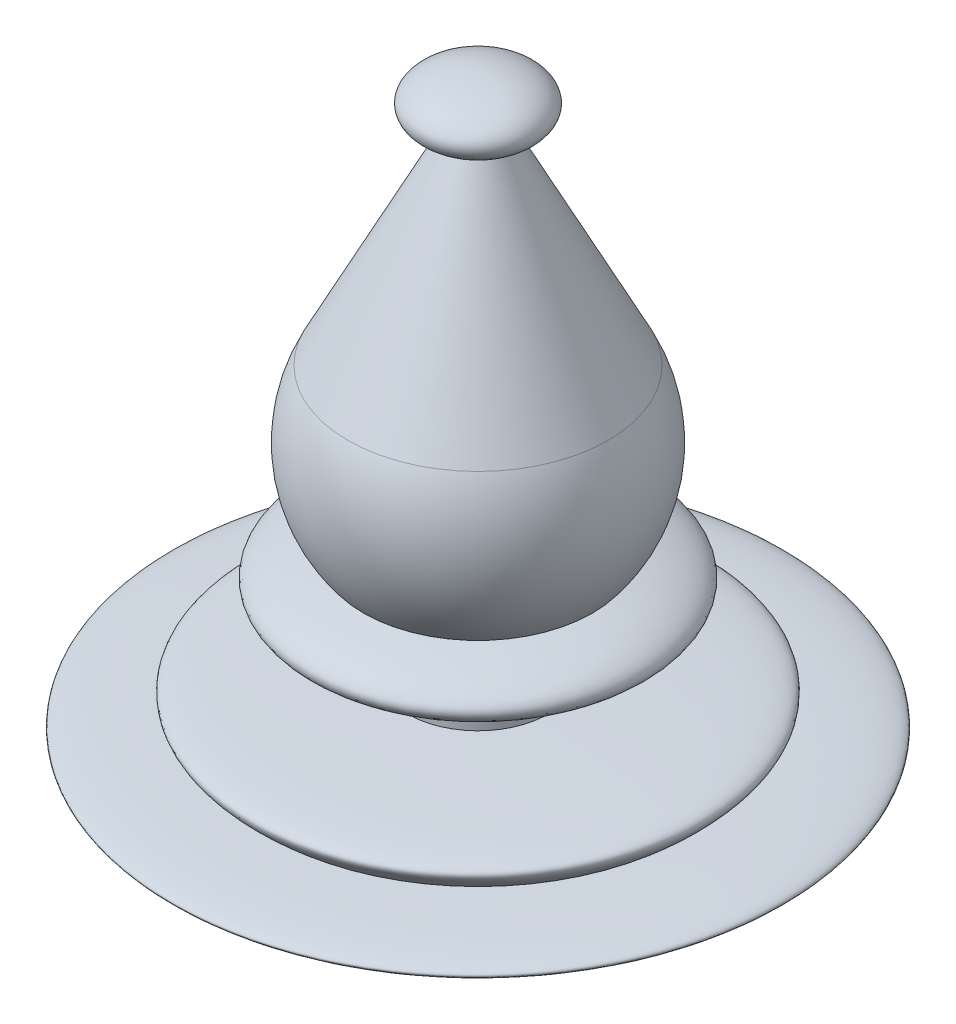
ISO-10303-21;
HEADER;
FILE_DESCRIPTION(('STEP AP214'),'2;1');
FILE_NAME('part.step','',(''),(''),'','','');
FILE_SCHEMA(('AUTOMOTIVE_DESIGN { 1 0 10303 214 1 1 1 1 }'));
ENDSEC;
DATA;
#1=APPLICATION_CONTEXT('core data for automotive mechanical design processes');
#2=APPLICATION_PROTOCOL_DEFINITION('international standard','automotive_design',2000,#1);
#3=PRODUCT_CONTEXT('',#1,'mechanical');
#4=PRODUCT('Part','Part','',(#3));
#5=PRODUCT_RELATED_PRODUCT_CATEGORY('part','',(#4));
#6=PRODUCT_DEFINITION_FORMATION('','',#4);
#7=PRODUCT_DEFINITION_CONTEXT('part definition',#1,'design');
#8=PRODUCT_DEFINITION('design','',#6,#7);
#9=PRODUCT_DEFINITION_SHAPE('','',#8);
#10=(LENGTH_UNIT() NAMED_UNIT(*) SI_UNIT(.MILLI.,.METRE.));
#11=(NAMED_UNIT(*) PLANE_ANGLE_UNIT() SI_UNIT($,.RADIAN.));
#12=(NAMED_UNIT(*) SI_UNIT($,.STERADIAN.) SOLID_ANGLE_UNIT());
#13=UNCERTAINTY_MEASURE_WITH_UNIT(LENGTH_MEASURE(1.E-05),#10,'distance_accuracy_value','');
#14=(GEOMETRIC_REPRESENTATION_CONTEXT(3) GLOBAL_UNCERTAINTY_ASSIGNED_CONTEXT((#13)) GLOBAL_UNIT_ASSIGNED_CONTEXT((#10,
#11,#12)) REPRESENTATION_CONTEXT('',''));
#15=CARTESIAN_POINT('',(0.,0.,0.));
#16=DIRECTION('',(0.,0.,1.));
#17=DIRECTION('',(1.,0.,0.));
#18=AXIS2_PLACEMENT_3D('',#15,#16,#17);
#19=CARTESIAN_POINT('',(6.00000000000001,-17.049402030691,0.));
#20=CARTESIAN_POINT('',(20.9160069814834,-17.5127391590238,0.));
#21=CARTESIAN_POINT('',(18.,-20.049402030691,0.));
#22=(BOUNDED_CURVE() B_SPLINE_CURVE(2,(#19,#20,#21),.UNSPECIFIED.,.F.,
.F.) B_SPLINE_CURVE_WITH_KNOTS((3,3),(0.,1.),
.UNSPECIFIED.) CURVE() GEOMETRIC_REPRESENTATION_ITEM() RATIONAL_B_SPLINE_CURVE((1.,
2.72010071933434,1.)) REPRESENTATION_ITEM(''));
#23=CARTESIAN_POINT('',(0.,27.2617133775583,0.));
#24=DIRECTION('',(0.,1.,0.));
#25=AXIS1_PLACEMENT('',#23,#24);
#26=SURFACE_OF_REVOLUTION('',#22,#25);
#27=CARTESIAN_POINT('',(0.,-20.049402030691,0.));
#28=DIRECTION('',(0.,1.,0.));
#29=DIRECTION('',(-1.,0.,0.));
#30=AXIS2_PLACEMENT_3D('',#27,#28,#29);
#31=CIRCLE('',#30,18.);
#32=CARTESIAN_POINT('',(-18.,-20.049402030691,0.));
#33=VERTEX_POINT('',#32);
#34=EDGE_CURVE('E74',#33,#33,#31,.T.);
#35=ORIENTED_EDGE('',*,*,#34,.T.);
#36=EDGE_LOOP('',(#35));
#37=FACE_BOUND('',#36,.T.);
#38=CARTESIAN_POINT('',(0.,-17.049402030691,0.));
#39=DIRECTION('',(0.,1.,0.));
#40=DIRECTION('',(-1.,0.,0.));
#41=AXIS2_PLACEMENT_3D('',#38,#39,#40);
#42=CIRCLE('',#41,6.);
#43=CARTESIAN_POINT('',(-6.,-17.049402030691,0.));
#44=VERTEX_POINT('',#43);
#45=EDGE_CURVE('E11',#44,#44,#42,.T.);
#46=ORIENTED_EDGE('',*,*,#45,.F.);
#47=EDGE_LOOP('',(#46));
#48=FACE_BOUND('',#47,.T.);
#49=ADVANCED_FACE('F47',(#37,#48),#26,.F.);
#50=CARTESIAN_POINT('',(0.,27.2617133775583,0.));
#51=DIRECTION('',(0.,1.,0.));
#52=DIRECTION('',(-1.,0.,0.));
#53=AXIS2_PLACEMENT_3D('',#50,#51,#52);
#54=CYLINDRICAL_SURFACE('',#53,6.);
#55=ORIENTED_EDGE('',*,*,#45,.T.);
#56=EDGE_LOOP('',(#55));
#57=FACE_BOUND('',#56,.T.);
#58=CARTESIAN_POINT('',(0.,-12.8021493208476,0.));
#59=DIRECTION('',(0.,1.,0.));
#60=DIRECTION('',(-1.,0.,0.));
#61=AXIS2_PLACEMENT_3D('',#58,#59,#60);
#62=CIRCLE('',#61,6.);
#63=CARTESIAN_POINT('',(-5.99999999999999,-12.8021493208476,0.));
#64=VERTEX_POINT('',#63);
#65=EDGE_CURVE('E56',#64,#64,#62,.T.);
#66=ORIENTED_EDGE('',*,*,#65,.F.);
#67=EDGE_LOOP('',(#66));
#68=FACE_BOUND('',#67,.T.);
#69=ADVANCED_FACE('F93',(#57,#68),#54,.T.);
#70=CARTESIAN_POINT('',(0.,-10.,0.));
#71=DIRECTION('',(0.,0.,1.));
#72=DIRECTION('',(1.,0.,0.));
#73=AXIS2_PLACEMENT_3D('',#70,#71,#72);
#74=ELLIPSE('',#73,14.3874945699382,3.08303455070103);
#75=TRIMMED_CURVE('',#74,(PARAMETER_VALUE(4.71238898038469)),
(PARAMETER_VALUE(7.85398163397448)),.T.,.PARAMETER.);
#76=CARTESIAN_POINT('',(0.,27.2617133775583,0.));
#77=DIRECTION('',(0.,1.,0.));
#78=AXIS1_PLACEMENT('',#76,#77);
#79=SURFACE_OF_REVOLUTION('',#75,#78);
#80=CARTESIAN_POINT('',(0.,-7.73374733032995,0.));
#81=DIRECTION('',(0.,1.,0.));
#82=DIRECTION('',(-1.,0.,0.));
#83=AXIS2_PLACEMENT_3D('',#80,#81,#82);
#84=CIRCLE('',#83,9.75456230633658);
#85=CARTESIAN_POINT('',(9.75456230633658,-7.73374733032995,0.));
#86=VERTEX_POINT('',#85);
#87=EDGE_CURVE('E79',#86,#86,#84,.T.);
#88=ORIENTED_EDGE('',*,*,#87,.F.);
#89=EDGE_LOOP('',(#88));
#90=FACE_BOUND('',#89,.T.);
#91=ORIENTED_EDGE('',*,*,#65,.T.);
#92=EDGE_LOOP('',(#91));
#93=FACE_BOUND('',#92,.T.);
#94=ADVANCED_FACE('F91',(#90,#93),#79,.T.);
#95=CARTESIAN_POINT('',(0.,0.,0.));
#96=DIRECTION('',(0.,1.,0.));
#97=DIRECTION('',(1.,0.,0.));
#98=AXIS2_PLACEMENT_3D('',#95,#96,#97);
#99=SPHERICAL_SURFACE('',#98,12.4483867853464);
#100=CARTESIAN_POINT('',(0.,5.67008957160824,0.));
#101=DIRECTION('',(0.,1.,0.));
#102=DIRECTION('',(-1.,0.,0.));
#103=AXIS2_PLACEMENT_3D('',#100,#101,#102);
#104=CIRCLE('',#103,11.0820764212997);
#105=CARTESIAN_POINT('',(11.0820764212997,5.67008957160824,0.));
#106=VERTEX_POINT('',#105);
#107=EDGE_CURVE('E73',#106,#106,#104,.T.);
#108=CARTESIAN_POINT('',(11.0820764212997,5.67008957160824,0.));
#109=CARTESIAN_POINT('',(11.1496033400676,5.5381122258004,0.));
#110=CARTESIAN_POINT('',(11.2147704914206,5.40492760103505,0.));
#111=CARTESIAN_POINT('',(11.3403069153199,5.1363160355714,0.));
#112=CARTESIAN_POINT('',(11.4006761878664,5.0008890948731,0.));
#113=CARTESIAN_POINT('',(11.5165385101762,4.72796513952557,0.));
#114=CARTESIAN_POINT('',(11.5720315599395,4.59046812487634,0.));
#115=CARTESIAN_POINT('',(11.6780709570877,4.31357967250652,0.));
#116=CARTESIAN_POINT('',(11.7286173044724,4.17418823478592,0.));
#117=CARTESIAN_POINT('',(11.8246986911405,3.89368879954967,0.));
#118=CARTESIAN_POINT('',(11.8702337304238,3.75258080203403,0.));
#119=CARTESIAN_POINT('',(11.9562344089541,3.46882835640334,0.));
#120=CARTESIAN_POINT('',(11.9967000482011,3.32618390828829,0.));
#121=CARTESIAN_POINT('',(12.0725102732844,3.03954061688942,0.));
#122=CARTESIAN_POINT('',(12.1078548591208,2.8955417736056,0.));
#123=CARTESIAN_POINT('',(12.1733778685189,2.60637347988094,0.));
#124=CARTESIAN_POINT('',(12.2035562920807,2.46120402944009,0.));
#125=CARTESIAN_POINT('',(12.2587084594241,2.16987980241168,0.));
#126=CARTESIAN_POINT('',(12.2836822032058,2.02372502582411,0.));
#127=CARTESIAN_POINT('',(12.3283931368764,1.73061668537805,0.));
#128=CARTESIAN_POINT('',(12.3481303267652,1.58366312151956,0.));
#129=CARTESIAN_POINT('',(12.3823429618411,1.28914476483165,0.));
#130=CARTESIAN_POINT('',(12.3968184070282,1.14157997200225,0.));
#131=CARTESIAN_POINT('',(12.420489077553,0.846027495810605,0.));
#132=CARTESIAN_POINT('',(12.4296843028907,0.69803981244837,0.));
#133=CARTESIAN_POINT('',(12.4427827977556,0.401830433363157,0.));
#134=CARTESIAN_POINT('',(12.4466860672827,0.253608737640178,0.));
#135=CARTESIAN_POINT('',(12.4491956687446,-0.0428794893206436,0.));
#136=CARTESIAN_POINT('',(12.4478020006794,-0.191146020558486,0.));
#137=CARTESIAN_POINT('',(12.4397195057093,-0.487534684479524,0.));
#138=CARTESIAN_POINT('',(12.4330306788043,-0.635656817162721,0.));
#139=CARTESIAN_POINT('',(12.4143664031718,-0.931567634202187,0.));
#140=CARTESIAN_POINT('',(12.4023909544443,-1.07935631855846,0.));
#141=CARTESIAN_POINT('',(12.3731687195528,-1.37441161475527,0.));
#142=CARTESIAN_POINT('',(12.3559219333888,-1.52167822659582,0.));
#143=CARTESIAN_POINT('',(12.3161790358715,-1.81550141989883,0.));
#144=CARTESIAN_POINT('',(12.2936829245181,-1.96205800136129,0.));
#145=CARTESIAN_POINT('',(12.243470088636,-2.25427408226464,0.));
#146=CARTESIAN_POINT('',(12.2157533641072,-2.39993358170553,0.));
#147=CARTESIAN_POINT('',(12.1551346770093,-2.69016959187726,0.));
#148=CARTESIAN_POINT('',(12.1222327144403,-2.83474610260809,0.));
#149=CARTESIAN_POINT('',(12.0512855443682,-3.12263161090008,0.));
#150=CARTESIAN_POINT('',(12.0132403368652,-3.26594060846123,0.));
#151=CARTESIAN_POINT('',(11.9320552344094,-3.55110818369611,0.));
#152=CARTESIAN_POINT('',(11.8889153394566,-3.69296676136985,0.));
#153=CARTESIAN_POINT('',(11.7975959219764,-3.97505244129007,0.));
#154=CARTESIAN_POINT('',(11.7494163994489,-4.11527954353654,0.));
#155=CARTESIAN_POINT('',(11.6480792188604,-4.39392329935949,0.));
#156=CARTESIAN_POINT('',(11.5949215607994,-4.53233995293595,0.));
#157=CARTESIAN_POINT('',(11.4836959546851,-4.8071861487635,0.));
#158=CARTESIAN_POINT('',(11.4256280066317,-4.9436156910146,0.));
#159=CARTESIAN_POINT('',(11.3046559336664,-5.21431353810372,0.));
#160=CARTESIAN_POINT('',(11.2417518087544,-5.34858184294175,0.));
#161=CARTESIAN_POINT('',(11.1111876656521,-5.61478584604299,0.));
#162=CARTESIAN_POINT('',(11.0435276474618,-5.7467215443062,0.));
#163=CARTESIAN_POINT('',(10.9035380788962,-6.00809194776057,0.));
#164=CARTESIAN_POINT('',(10.8312085285209,-6.13752665295172,0.));
#165=CARTESIAN_POINT('',(10.6819721883911,-6.39372985514981,0.));
#166=CARTESIAN_POINT('',(10.6050653986365,-6.52049835215675,0.));
#167=CARTESIAN_POINT('',(10.4467728192468,-6.77120740287784,0.));
#168=CARTESIAN_POINT('',(10.3653870296118,-6.89514795659199,0.));
#169=CARTESIAN_POINT('',(10.1982400157458,-7.14004270722834,0.));
#170=CARTESIAN_POINT('',(10.1124787915148,-7.26099690415053,0.));
#171=CARTESIAN_POINT('',(9.93669151666482,-7.49976541301858,0.));
#172=CARTESIAN_POINT('',(9.84666546604576,-7.61757972496444,0.));
#173=CARTESIAN_POINT('',(9.75456230633658,-7.73374733032995,0.));
#174=B_SPLINE_CURVE_WITH_KNOTS('',3,(#108,#109,#110,#111,#112,#113,#114,#115,#116,#117,#118,
#119,#120,#121,#122,#123,#124,#125,#126,#127,#128,#129,#130,#131,#132,#133,#134,#135,#136,#137,
#138,#139,#140,#141,#142,#143,#144,#145,#146,#147,#148,#149,#150,#151,#152,#153,#154,#155,#156,
#157,#158,#159,#160,#161,#162,#163,#164,#165,#166,#167,#168,#169,#170,#171,#172,#173),
.UNSPECIFIED.,.F.,.F.,(4,2,2,2,2,2,2,2,2,2,2,2,2,2,2,2,2,2,2,2,2,2,2,2,2,2,2,2,2,2,2,2,4),(0.,
0.44472462225828,0.889449244516561,1.33417386677484,1.77889848903312,2.2236231112914,
2.66834773354968,3.11307235580796,3.55779697806624,4.00252160032452,4.4472462225828,
4.89197084484108,5.33669546709936,5.78142008935764,6.22614471161592,6.6708693338742,
7.11559395613248,7.56031857839076,8.00504320064904,8.44976782290732,8.8944924451656,
9.33921706742388,9.78394168968216,10.2286663119404,10.6733909341987,11.118115556457,
11.5628401787153,12.0075648009736,12.4522894232318,12.8970140454901,13.3417386677484,
13.7864632900067,14.231187912265),.UNSPECIFIED.);
#175=EDGE_CURVE('BSEAM100',#106,#86,#174,.T.);
#176=ORIENTED_EDGE('',*,*,#107,.F.);
#177=ORIENTED_EDGE('',*,*,#87,.T.);
#178=ORIENTED_EDGE('',*,*,#175,.T.);
#179=ORIENTED_EDGE('',*,*,#175,.F.);
#180=EDGE_LOOP('',(#176,#178,#177,#179));
#181=FACE_BOUND('',#180,.T.);
#182=ADVANCED_FACE('F100',(#181),#99,.T.);
#183=CARTESIAN_POINT('',(0.,22.9729128370593,0.));
#184=DIRECTION('',(0.,-1.,0.));
#185=DIRECTION('',(1.,0.,0.));
#186=AXIS2_PLACEMENT_3D('',#183,#184,#185);
#187=CONICAL_SURFACE('',#186,2.22917250446247,0.472920192056634);
#188=CARTESIAN_POINT('',(0.,22.9729128370593,0.));
#189=DIRECTION('',(0.,1.,0.));
#190=DIRECTION('',(-1.,0.,0.));
#191=AXIS2_PLACEMENT_3D('',#188,#189,#190);
#192=CIRCLE('',#191,2.22917250446247);
#193=CARTESIAN_POINT('',(2.22917250446247,22.9729128370593,0.));
#194=VERTEX_POINT('',#193);
#195=EDGE_CURVE('E70',#194,#194,#192,.T.);
#196=CARTESIAN_POINT('',(11.0820764212997,5.67008957160824,0.));
#197=CARTESIAN_POINT('',(10.989858672166,5.85032731395669,0.));
#198=CARTESIAN_POINT('',(10.8976409230323,6.03056505630514,0.));
#199=CARTESIAN_POINT('',(10.7132054247648,6.39104054100204,0.));
#200=CARTESIAN_POINT('',(10.6209876756311,6.57127828335049,0.));
#201=CARTESIAN_POINT('',(10.4365521773637,6.93175376804738,0.));
#202=CARTESIAN_POINT('',(10.34433442823,7.11199151039583,0.));
#203=CARTESIAN_POINT('',(10.1598989299625,7.47246699509273,0.));
#204=CARTESIAN_POINT('',(10.0676811808288,7.65270473744117,0.));
#205=CARTESIAN_POINT('',(9.88324568256136,8.01318022213807,0.));
#206=CARTESIAN_POINT('',(9.79102793342764,8.19341796448652,0.));
#207=CARTESIAN_POINT('',(9.60659243516019,8.55389344918342,0.));
#208=CARTESIAN_POINT('',(9.51437468602647,8.73413119153187,0.));
#209=CARTESIAN_POINT('',(9.32993918775903,9.09460667622876,0.));
#210=CARTESIAN_POINT('',(9.23772143862531,9.27484441857721,0.));
#211=CARTESIAN_POINT('',(9.05328594035786,9.63531990327411,0.));
#212=CARTESIAN_POINT('',(8.96106819122414,9.81555764562256,0.));
#213=CARTESIAN_POINT('',(8.7766326929567,10.1760331303195,0.));
#214=CARTESIAN_POINT('',(8.68441494382298,10.3562708726679,0.));
#215=CARTESIAN_POINT('',(8.49997944555554,10.7167463573648,0.));
#216=CARTESIAN_POINT('',(8.40776169642181,10.8969840997132,0.));
#217=CARTESIAN_POINT('',(8.22332619815437,11.2574595844101,0.));
#218=CARTESIAN_POINT('',(8.13110844902065,11.4376973267586,0.));
#219=CARTESIAN_POINT('',(7.9466729507532,11.7981728114555,0.));
#220=CARTESIAN_POINT('',(7.85445520161948,11.9784105538039,0.));
#221=CARTESIAN_POINT('',(7.67001970335204,12.3388860385008,0.));
#222=CARTESIAN_POINT('',(7.57780195421832,12.5191237808493,0.));
#223=CARTESIAN_POINT('',(7.39336645595087,12.8795992655462,0.));
#224=CARTESIAN_POINT('',(7.30114870681715,13.0598370078946,0.));
#225=CARTESIAN_POINT('',(7.11671320854971,13.4203124925915,0.));
#226=CARTESIAN_POINT('',(7.02449545941599,13.60055023494,0.));
#227=CARTESIAN_POINT('',(6.84005996114854,13.9610257196369,0.));
#228=CARTESIAN_POINT('',(6.74784221201482,14.1412634619853,0.));
#229=CARTESIAN_POINT('',(6.56340671374738,14.5017389466822,0.));
#230=CARTESIAN_POINT('',(6.47118896461366,14.6819766890307,0.));
#231=CARTESIAN_POINT('',(6.28675346634622,15.0424521737276,0.));
#232=CARTESIAN_POINT('',(6.19453571721249,15.222689916076,0.));
#233=CARTESIAN_POINT('',(6.01010021894505,15.5831654007729,0.));
#234=CARTESIAN_POINT('',(5.91788246981133,15.7634031431213,0.));
#235=CARTESIAN_POINT('',(5.73344697154389,16.1238786278183,0.));
#236=CARTESIAN_POINT('',(5.64122922241017,16.3041163701667,0.));
#237=CARTESIAN_POINT('',(5.45679372414272,16.6645918548636,0.));
#238=CARTESIAN_POINT('',(5.364575975009,16.844829597212,0.));
#239=CARTESIAN_POINT('',(5.18014047674156,17.2053050819089,0.));
#240=CARTESIAN_POINT('',(5.08792272760784,17.3855428242574,0.));
#241=CARTESIAN_POINT('',(4.90348722934039,17.7460183089543,0.));
#242=CARTESIAN_POINT('',(4.81126948020667,17.9262560513027,0.));
#243=CARTESIAN_POINT('',(4.62683398193923,18.2867315359996,0.));
#244=CARTESIAN_POINT('',(4.53461623280551,18.4669692783481,0.));
#245=CARTESIAN_POINT('',(4.35018073453806,18.827444763045,0.));
#246=CARTESIAN_POINT('',(4.25796298540434,19.0076825053934,0.));
#247=CARTESIAN_POINT('',(4.0735274871369,19.3681579900903,0.));
#248=CARTESIAN_POINT('',(3.98130973800318,19.5483957324388,0.));
#249=CARTESIAN_POINT('',(3.79687423973574,19.9088712171357,0.));
#250=CARTESIAN_POINT('',(3.70465649060201,20.0891089594841,0.));
#251=CARTESIAN_POINT('',(3.52022099233457,20.449584444181,0.));
#252=CARTESIAN_POINT('',(3.42800324320085,20.6298221865295,0.));
#253=CARTESIAN_POINT('',(3.24356774493341,20.9902976712264,0.));
#254=CARTESIAN_POINT('',(3.15134999579968,21.1705354135748,0.));
#255=CARTESIAN_POINT('',(2.96691449753224,21.5310108982717,0.));
#256=CARTESIAN_POINT('',(2.87469674839852,21.7112486406201,0.));
#257=CARTESIAN_POINT('',(2.69026125013108,22.071724125317,0.));
#258=CARTESIAN_POINT('',(2.59804350099735,22.2519618676655,0.));
#259=CARTESIAN_POINT('',(2.41360800272991,22.6124373523624,0.));
#260=CARTESIAN_POINT('',(2.32139025359619,22.7926750947108,0.));
#261=CARTESIAN_POINT('',(2.22917250446247,22.9729128370593,0.));
#262=B_SPLINE_CURVE_WITH_KNOTS('',3,(#196,#197,#198,#199,#200,#201,#202,#203,#204,#205,#206,
#207,#208,#209,#210,#211,#212,#213,#214,#215,#216,#217,#218,#219,#220,#221,#222,#223,#224,#225,
#226,#227,#228,#229,#230,#231,#232,#233,#234,#235,#236,#237,#238,#239,#240,#241,#242,#243,#244,
#245,#246,#247,#248,#249,#250,#251,#252,#253,#254,#255,#256,#257,#258,#259,#260,#261),
.UNSPECIFIED.,.F.,.F.,(4,2,2,2,2,2,2,2,2,2,2,2,2,2,2,2,2,2,2,2,2,2,2,2,2,2,2,2,2,2,2,2,4),(0.,
0.607377817506865,1.21475563501373,1.82213345252059,2.42951127002745,3.03688908753432,
3.64426690504118,4.25164472254805,4.85902254005491,5.46640035756178,6.07377817506864,
6.6811559925755,7.28853381008237,7.89591162758923,8.50328944509609,9.11066726260296,
9.71804508010982,10.3254228976167,10.9328007151235,11.5401785326304,12.1475563501373,
12.7549341676441,13.362311985151,13.9696898026579,14.5770676201647,15.1844454376716,
15.7918232551785,16.3992010726853,17.0065788901922,17.613956707699,18.2213345252059,
18.8287123427128,19.4360901602196),.UNSPECIFIED.);
#263=EDGE_CURVE('BSEAM66',#106,#194,#262,.T.);
#264=ORIENTED_EDGE('',*,*,#107,.T.);
#265=ORIENTED_EDGE('',*,*,#195,.F.);
#266=ORIENTED_EDGE('',*,*,#263,.T.);
#267=ORIENTED_EDGE('',*,*,#263,.F.);
#268=EDGE_LOOP('',(#264,#266,#265,#267));
#269=FACE_BOUND('',#268,.T.);
#270=ADVANCED_FACE('F66',(#269),#187,.T.);
#271=CARTESIAN_POINT('',(0.,25.,0.));
#272=DIRECTION('',(0.,0.,1.));
#273=DIRECTION('',(1.,0.,0.));
#274=AXIS2_PLACEMENT_3D('',#271,#272,#273);
#275=ELLIPSE('',#274,5.02602972790722,2.26171337755825);
#276=TRIMMED_CURVE('',#275,(PARAMETER_VALUE(4.71238898038469)),
(PARAMETER_VALUE(7.85398163397448)),.T.,.PARAMETER.);
#277=CARTESIAN_POINT('',(0.,27.2617133775583,0.));
#278=DIRECTION('',(0.,1.,0.));
#279=AXIS1_PLACEMENT('',#277,#278);
#280=SURFACE_OF_REVOLUTION('',#276,#279);
#281=CARTESIAN_POINT('',(0.,27.2617133775583,0.));
#282=VERTEX_POINT('',#281);
#283=VERTEX_LOOP('',#282);
#284=FACE_BOUND('',#283,.T.);
#285=ORIENTED_EDGE('',*,*,#195,.T.);
#286=EDGE_LOOP('',(#285));
#287=FACE_BOUND('',#286,.T.);
#288=ADVANCED_FACE('F62',(#284,#287),#280,.T.);
#289=CARTESIAN_POINT('',(0.,-22.549402030691,0.));
#290=DIRECTION('',(0.,0.,1.));
#291=DIRECTION('',(0.998266249616545,0.058859959875258,0.));
#292=AXIS2_PLACEMENT_3D('',#289,#290,#291);
#293=ELLIPSE('',#292,26.0306359443431,2.);
#294=TRIMMED_CURVE('',#293,(PARAMETER_VALUE(4.707858796615)),(PARAMETER_VALUE(7.8494514502048)),
.T.,.PARAMETER.);
#295=CARTESIAN_POINT('',(0.,27.2617133775583,0.));
#296=DIRECTION('',(0.,1.,0.));
#297=AXIS1_PLACEMENT('',#295,#296);
#298=SURFACE_OF_REVOLUTION('',#294,#297);
#299=ORIENTED_EDGE('',*,*,#34,.F.);
#300=EDGE_LOOP('',(#299));
#301=FACE_BOUND('',#300,.T.);
#302=CARTESIAN_POINT('',(0.,-24.5528549955071,0.));
#303=VERTEX_POINT('',#302);
#304=VERTEX_LOOP('',#303);
#305=FACE_BOUND('',#304,.T.);
#306=ADVANCED_FACE('F65',(#301,#305),#298,.T.);
#307=CLOSED_SHELL('',(#49,#69,#94,#182,#270,#288,#306));
#308=MANIFOLD_SOLID_BREP('B2',#307);
#309=ADVANCED_BREP_SHAPE_REPRESENTATION('',(#18,#308),#14);
#310=SHAPE_DEFINITION_REPRESENTATION(#9,#309);
ENDSEC;
END-ISO-10303-21;
